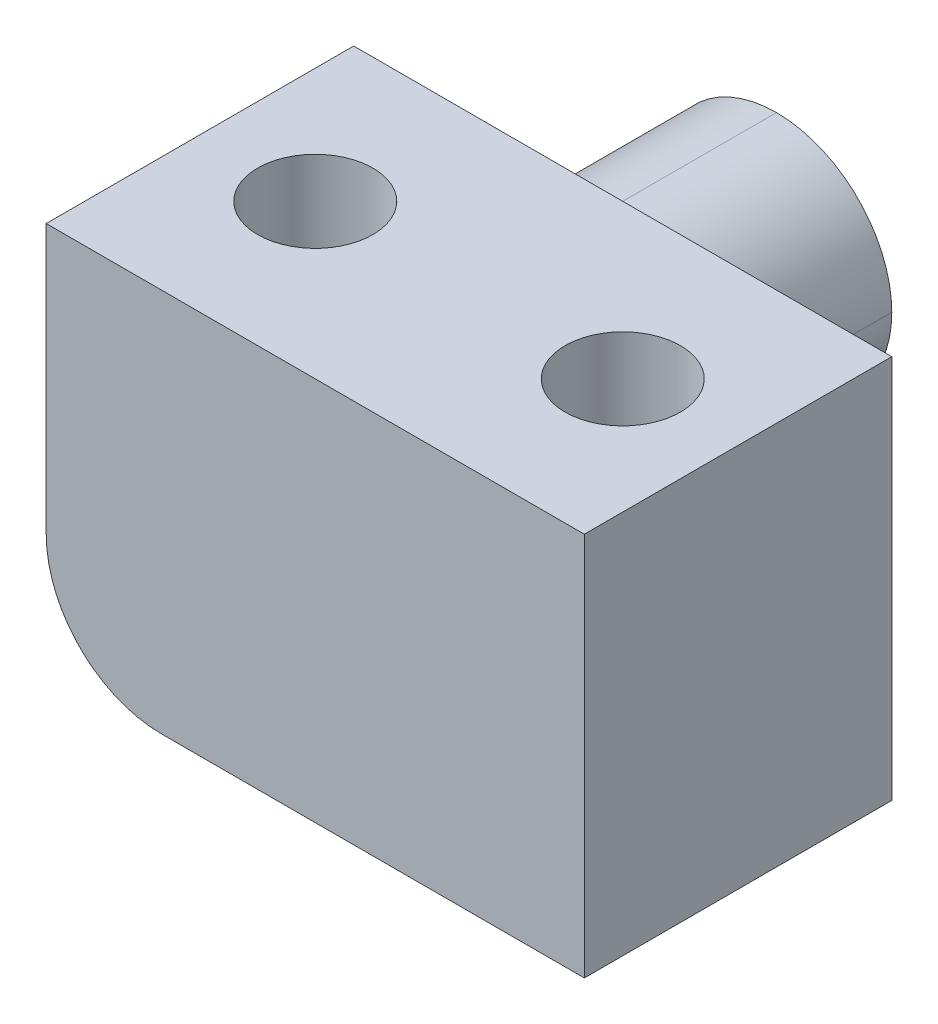
ISO-10303-21;
HEADER;
FILE_DESCRIPTION(('STEP AP214'),'2;1');
FILE_NAME('part.step','',(''),(''),'','','');
FILE_SCHEMA(('AUTOMOTIVE_DESIGN { 1 0 10303 214 1 1 1 1 }'));
ENDSEC;
DATA;
#1=APPLICATION_CONTEXT('core data for automotive mechanical design processes');
#2=APPLICATION_PROTOCOL_DEFINITION('international standard','automotive_design',2000,#1);
#3=PRODUCT_CONTEXT('',#1,'mechanical');
#4=PRODUCT('Part','Part','',(#3));
#5=PRODUCT_RELATED_PRODUCT_CATEGORY('part','',(#4));
#6=PRODUCT_DEFINITION_FORMATION('','',#4);
#7=PRODUCT_DEFINITION_CONTEXT('part definition',#1,'design');
#8=PRODUCT_DEFINITION('design','',#6,#7);
#9=PRODUCT_DEFINITION_SHAPE('','',#8);
#10=(LENGTH_UNIT() NAMED_UNIT(*) SI_UNIT(.MILLI.,.METRE.));
#11=(NAMED_UNIT(*) PLANE_ANGLE_UNIT() SI_UNIT($,.RADIAN.));
#12=(NAMED_UNIT(*) SI_UNIT($,.STERADIAN.) SOLID_ANGLE_UNIT());
#13=UNCERTAINTY_MEASURE_WITH_UNIT(LENGTH_MEASURE(1.E-05),#10,'distance_accuracy_value','');
#14=(GEOMETRIC_REPRESENTATION_CONTEXT(3) GLOBAL_UNCERTAINTY_ASSIGNED_CONTEXT((#13)) GLOBAL_UNIT_ASSIGNED_CONTEXT((#10,
#11,#12)) REPRESENTATION_CONTEXT('',''));
#15=CARTESIAN_POINT('',(0.,0.,0.));
#16=DIRECTION('',(0.,0.,1.));
#17=DIRECTION('',(1.,0.,0.));
#18=AXIS2_PLACEMENT_3D('',#15,#16,#17);
#19=CARTESIAN_POINT('',(-1.5,3.,4.));
#20=DIRECTION('',(1.,0.,0.));
#21=DIRECTION('',(0.,0.,-1.));
#22=AXIS2_PLACEMENT_3D('',#19,#20,#21);
#23=PLANE('',#22);
#24=DIRECTION('',(0.,-1.,0.));
#25=VECTOR('',#24,1.);
#26=CARTESIAN_POINT('',(-1.5,5.,0.));
#27=LINE('',#26,#25);
#28=CARTESIAN_POINT('',(-1.5,5.,0.));
#29=VERTEX_POINT('',#28);
#30=CARTESIAN_POINT('',(-1.5,1.5,0.));
#31=VERTEX_POINT('',#30);
#32=EDGE_CURVE('E106',#29,#31,#27,.T.);
#33=ORIENTED_EDGE('',*,*,#32,.T.);
#34=DIRECTION('',(0.,0.,1.));
#35=VECTOR('',#34,1.);
#36=CARTESIAN_POINT('',(-1.5,1.5,4.));
#37=LINE('',#36,#35);
#38=CARTESIAN_POINT('',(-1.5,1.5,4.));
#39=VERTEX_POINT('',#38);
#40=EDGE_CURVE('E163',#31,#39,#37,.T.);
#41=ORIENTED_EDGE('',*,*,#40,.T.);
#42=DIRECTION('',(0.,-1.,0.));
#43=VECTOR('',#42,1.);
#44=CARTESIAN_POINT('',(-1.5,3.,4.));
#45=LINE('',#44,#43);
#46=CARTESIAN_POINT('',(-1.5,5.,4.));
#47=VERTEX_POINT('',#46);
#48=EDGE_CURVE('E128',#47,#39,#45,.T.);
#49=ORIENTED_EDGE('',*,*,#48,.F.);
#50=DIRECTION('',(0.,0.,-1.));
#51=VECTOR('',#50,1.);
#52=CARTESIAN_POINT('',(-1.5,5.,4.));
#53=LINE('',#52,#51);
#54=EDGE_CURVE('E122',#47,#29,#53,.T.);
#55=ORIENTED_EDGE('',*,*,#54,.T.);
#56=EDGE_LOOP('',(#33,#41,#49,#55));
#57=FACE_BOUND('',#56,.T.);
#58=ADVANCED_FACE('F34',(#57),#23,.F.);
#59=CARTESIAN_POINT('',(1.5,3.,4.));
#60=DIRECTION('',(0.,0.,-1.));
#61=DIRECTION('',(-1.,0.,0.));
#62=AXIS2_PLACEMENT_3D('',#59,#60,#61);
#63=PLANE('',#62);
#64=ORIENTED_EDGE('',*,*,#48,.T.);
#65=CARTESIAN_POINT('',(0.,1.5,4.));
#66=DIRECTION('',(0.,0.,-1.));
#67=DIRECTION('',(-1.,0.,0.));
#68=AXIS2_PLACEMENT_3D('',#65,#66,#67);
#69=CIRCLE('',#68,1.5);
#70=CARTESIAN_POINT('',(0.,0.,4.));
#71=VERTEX_POINT('',#70);
#72=EDGE_CURVE('E165',#39,#71,#69,.F.);
#73=ORIENTED_EDGE('',*,*,#72,.T.);
#74=DIRECTION('',(1.,0.,0.));
#75=VECTOR('',#74,1.);
#76=CARTESIAN_POINT('',(1.5,0.,4.));
#77=LINE('',#76,#75);
#78=CARTESIAN_POINT('',(5.5,0.,4.));
#79=VERTEX_POINT('',#78);
#80=EDGE_CURVE('E146',#71,#79,#77,.T.);
#81=ORIENTED_EDGE('',*,*,#80,.T.);
#82=DIRECTION('',(0.,-1.,0.));
#83=VECTOR('',#82,1.);
#84=CARTESIAN_POINT('',(5.5,3.,4.));
#85=LINE('',#84,#83);
#86=CARTESIAN_POINT('',(5.5,5.,4.));
#87=VERTEX_POINT('',#86);
#88=EDGE_CURVE('E114',#87,#79,#85,.T.);
#89=ORIENTED_EDGE('',*,*,#88,.F.);
#90=DIRECTION('',(-1.,0.,0.));
#91=VECTOR('',#90,1.);
#92=CARTESIAN_POINT('',(-1.5,5.,4.));
#93=LINE('',#92,#91);
#94=EDGE_CURVE('E115',#87,#47,#93,.T.);
#95=ORIENTED_EDGE('',*,*,#94,.T.);
#96=EDGE_LOOP('',(#64,#73,#81,#89,#95));
#97=FACE_BOUND('',#96,.T.);
#98=ADVANCED_FACE('F201',(#97),#63,.F.);
#99=CARTESIAN_POINT('',(1.5,3.,-4.));
#100=DIRECTION('',(0.,0.,1.));
#101=DIRECTION('',(1.,0.,0.));
#102=AXIS2_PLACEMENT_3D('',#99,#100,#101);
#103=PLANE('',#102);
#104=CARTESIAN_POINT('',(0.,1.5,-4.));
#105=DIRECTION('',(0.,0.,1.));
#106=DIRECTION('',(1.,0.,0.));
#107=AXIS2_PLACEMENT_3D('',#104,#105,#106);
#108=CIRCLE('',#107,1.5);
#109=CARTESIAN_POINT('',(0.,3.,-4.));
#110=VERTEX_POINT('',#109);
#111=CARTESIAN_POINT('',(1.5,1.5,-4.));
#112=VERTEX_POINT('',#111);
#113=EDGE_CURVE('E153',#110,#112,#108,.F.);
#114=ORIENTED_EDGE('',*,*,#113,.T.);
#115=CARTESIAN_POINT('',(0.,1.5,-4.));
#116=DIRECTION('',(0.,0.,1.));
#117=DIRECTION('',(1.,0.,0.));
#118=AXIS2_PLACEMENT_3D('',#115,#116,#117);
#119=CIRCLE('',#118,1.5);
#120=CARTESIAN_POINT('',(0.,0.,-4.));
#121=VERTEX_POINT('',#120);
#122=EDGE_CURVE('E155',#112,#121,#119,.F.);
#123=ORIENTED_EDGE('',*,*,#122,.T.);
#124=CARTESIAN_POINT('',(0.,1.5,-4.));
#125=DIRECTION('',(0.,0.,1.));
#126=DIRECTION('',(1.,0.,0.));
#127=AXIS2_PLACEMENT_3D('',#124,#125,#126);
#128=CIRCLE('',#127,1.5);
#129=CARTESIAN_POINT('',(-1.5,1.5,-4.));
#130=VERTEX_POINT('',#129);
#131=EDGE_CURVE('E149',#121,#130,#128,.F.);
#132=ORIENTED_EDGE('',*,*,#131,.T.);
#133=CARTESIAN_POINT('',(0.,1.5,-4.));
#134=DIRECTION('',(0.,0.,1.));
#135=DIRECTION('',(1.,0.,0.));
#136=AXIS2_PLACEMENT_3D('',#133,#134,#135);
#137=CIRCLE('',#136,1.5);
#138=EDGE_CURVE('E151',#130,#110,#137,.F.);
#139=ORIENTED_EDGE('',*,*,#138,.T.);
#140=EDGE_LOOP('',(#114,#123,#132,#139));
#141=FACE_BOUND('',#140,.T.);
#142=ADVANCED_FACE('F197',(#141),#103,.F.);
#143=CARTESIAN_POINT('',(0.,0.,0.));
#144=DIRECTION('',(0.,1.,0.));
#145=DIRECTION('',(0.,0.,1.));
#146=AXIS2_PLACEMENT_3D('',#143,#144,#145);
#147=PLANE('',#146);
#148=CARTESIAN_POINT('',(4.,0.,2.));
#149=DIRECTION('',(0.,1.,0.));
#150=DIRECTION('',(0.,0.,1.));
#151=AXIS2_PLACEMENT_3D('',#148,#149,#150);
#152=CIRCLE('',#151,0.75);
#153=CARTESIAN_POINT('',(4.,0.,2.75));
#154=VERTEX_POINT('',#153);
#155=EDGE_CURVE('E253',#154,#154,#152,.F.);
#156=ORIENTED_EDGE('',*,*,#155,.F.);
#157=EDGE_LOOP('',(#156));
#158=FACE_BOUND('',#157,.T.);
#159=ORIENTED_EDGE('',*,*,#80,.F.);
#160=DIRECTION('',(0.,0.,1.));
#161=VECTOR('',#160,1.);
#162=CARTESIAN_POINT('',(0.,0.,0.));
#163=LINE('',#162,#161);
#164=CARTESIAN_POINT('',(0.,0.,2.75));
#165=VERTEX_POINT('',#164);
#166=EDGE_CURVE('E161',#71,#165,#163,.F.);
#167=ORIENTED_EDGE('',*,*,#166,.T.);
#168=CARTESIAN_POINT('',(0.,0.,2.));
#169=DIRECTION('',(0.,1.,0.));
#170=DIRECTION('',(0.,0.,1.));
#171=AXIS2_PLACEMENT_3D('',#168,#169,#170);
#172=CIRCLE('',#171,0.75);
#173=CARTESIAN_POINT('',(0.,0.,1.25));
#174=VERTEX_POINT('',#173);
#175=EDGE_CURVE('E129',#174,#165,#172,.F.);
#176=ORIENTED_EDGE('',*,*,#175,.F.);
#177=DIRECTION('',(0.,0.,1.));
#178=VECTOR('',#177,1.);
#179=CARTESIAN_POINT('',(0.,0.,0.));
#180=LINE('',#179,#178);
#181=CARTESIAN_POINT('',(0.,0.,0.));
#182=VERTEX_POINT('',#181);
#183=EDGE_CURVE('E158',#174,#182,#180,.F.);
#184=ORIENTED_EDGE('',*,*,#183,.T.);
#185=DIRECTION('',(-1.,0.,0.));
#186=VECTOR('',#185,1.);
#187=CARTESIAN_POINT('',(5.5,0.,0.));
#188=LINE('',#187,#186);
#189=CARTESIAN_POINT('',(5.5,0.,0.));
#190=VERTEX_POINT('',#189);
#191=EDGE_CURVE('E144',#190,#182,#188,.T.);
#192=ORIENTED_EDGE('',*,*,#191,.F.);
#193=DIRECTION('',(0.,0.,-1.));
#194=VECTOR('',#193,1.);
#195=CARTESIAN_POINT('',(5.5,0.,4.));
#196=LINE('',#195,#194);
#197=EDGE_CURVE('E140',#79,#190,#196,.T.);
#198=ORIENTED_EDGE('',*,*,#197,.F.);
#199=EDGE_LOOP('',(#159,#167,#176,#184,#192,#198));
#200=FACE_BOUND('',#199,.T.);
#201=ADVANCED_FACE('F194',(#158,#200),#147,.F.);
#202=CARTESIAN_POINT('',(5.5,3.,0.));
#203=DIRECTION('',(0.,0.,1.));
#204=DIRECTION('',(1.,0.,0.));
#205=AXIS2_PLACEMENT_3D('',#202,#203,#204);
#206=PLANE('',#205);
#207=CARTESIAN_POINT('',(0.,1.5,0.));
#208=DIRECTION('',(0.,0.,1.));
#209=DIRECTION('',(1.,0.,0.));
#210=AXIS2_PLACEMENT_3D('',#207,#208,#209);
#211=CIRCLE('',#210,1.5);
#212=CARTESIAN_POINT('',(1.5,1.5,0.));
#213=VERTEX_POINT('',#212);
#214=CARTESIAN_POINT('',(0.,3.,0.));
#215=VERTEX_POINT('',#214);
#216=EDGE_CURVE('E43',#213,#215,#211,.T.);
#217=ORIENTED_EDGE('',*,*,#216,.T.);
#218=CARTESIAN_POINT('',(0.,1.5,0.));
#219=DIRECTION('',(0.,0.,1.));
#220=DIRECTION('',(1.,0.,0.));
#221=AXIS2_PLACEMENT_3D('',#218,#219,#220);
#222=CIRCLE('',#221,1.5);
#223=EDGE_CURVE('E12',#215,#31,#222,.T.);
#224=ORIENTED_EDGE('',*,*,#223,.T.);
#225=ORIENTED_EDGE('',*,*,#32,.F.);
#226=DIRECTION('',(1.,0.,0.));
#227=VECTOR('',#226,1.);
#228=CARTESIAN_POINT('',(-1.5,5.,0.));
#229=LINE('',#228,#227);
#230=CARTESIAN_POINT('',(5.5,5.,0.));
#231=VERTEX_POINT('',#230);
#232=EDGE_CURVE('E110',#29,#231,#229,.T.);
#233=ORIENTED_EDGE('',*,*,#232,.T.);
#234=DIRECTION('',(0.,1.,0.));
#235=VECTOR('',#234,1.);
#236=CARTESIAN_POINT('',(5.5,3.,0.));
#237=LINE('',#236,#235);
#238=EDGE_CURVE('E142',#190,#231,#237,.T.);
#239=ORIENTED_EDGE('',*,*,#238,.F.);
#240=ORIENTED_EDGE('',*,*,#191,.T.);
#241=CARTESIAN_POINT('',(0.,1.5,0.));
#242=DIRECTION('',(0.,0.,1.));
#243=DIRECTION('',(1.,0.,0.));
#244=AXIS2_PLACEMENT_3D('',#241,#242,#243);
#245=CIRCLE('',#244,1.5);
#246=EDGE_CURVE('E173',#182,#213,#245,.T.);
#247=ORIENTED_EDGE('',*,*,#246,.T.);
#248=EDGE_LOOP('',(#217,#224,#225,#233,#239,#240,#247));
#249=FACE_BOUND('',#248,.T.);
#250=ADVANCED_FACE('F108',(#249),#206,.F.);
#251=CARTESIAN_POINT('',(5.5,0.,0.));
#252=DIRECTION('',(1.,0.,0.));
#253=DIRECTION('',(0.,0.,-1.));
#254=AXIS2_PLACEMENT_3D('',#251,#252,#253);
#255=PLANE('',#254);
#256=ORIENTED_EDGE('',*,*,#88,.T.);
#257=ORIENTED_EDGE('',*,*,#197,.T.);
#258=ORIENTED_EDGE('',*,*,#238,.T.);
#259=DIRECTION('',(0.,0.,1.));
#260=VECTOR('',#259,1.);
#261=CARTESIAN_POINT('',(5.5,5.,4.));
#262=LINE('',#261,#260);
#263=EDGE_CURVE('E125',#231,#87,#262,.T.);
#264=ORIENTED_EDGE('',*,*,#263,.T.);
#265=EDGE_LOOP('',(#256,#257,#258,#264));
#266=FACE_BOUND('',#265,.T.);
#267=ADVANCED_FACE('F187',(#266),#255,.T.);
#268=CARTESIAN_POINT('',(0.,5.,0.));
#269=DIRECTION('',(0.,-1.,0.));
#270=DIRECTION('',(0.,0.,-1.));
#271=AXIS2_PLACEMENT_3D('',#268,#269,#270);
#272=PLANE('',#271);
#273=CARTESIAN_POINT('',(4.,5.,2.));
#274=DIRECTION('',(0.,1.,0.));
#275=DIRECTION('',(0.,0.,1.));
#276=AXIS2_PLACEMENT_3D('',#273,#274,#275);
#277=CIRCLE('',#276,0.75);
#278=CARTESIAN_POINT('',(4.,5.,2.75));
#279=VERTEX_POINT('',#278);
#280=EDGE_CURVE('E225',#279,#279,#277,.T.);
#281=ORIENTED_EDGE('',*,*,#280,.F.);
#282=EDGE_LOOP('',(#281));
#283=FACE_BOUND('',#282,.T.);
#284=CARTESIAN_POINT('',(0.,5.,2.));
#285=DIRECTION('',(0.,1.,0.));
#286=DIRECTION('',(0.,0.,1.));
#287=AXIS2_PLACEMENT_3D('',#284,#285,#286);
#288=CIRCLE('',#287,0.75);
#289=CARTESIAN_POINT('',(0.,5.,2.75));
#290=VERTEX_POINT('',#289);
#291=EDGE_CURVE('E132',#290,#290,#288,.T.);
#292=ORIENTED_EDGE('',*,*,#291,.F.);
#293=EDGE_LOOP('',(#292));
#294=FACE_BOUND('',#293,.T.);
#295=ORIENTED_EDGE('',*,*,#54,.F.);
#296=ORIENTED_EDGE('',*,*,#94,.F.);
#297=ORIENTED_EDGE('',*,*,#263,.F.);
#298=ORIENTED_EDGE('',*,*,#232,.F.);
#299=EDGE_LOOP('',(#295,#296,#297,#298));
#300=FACE_BOUND('',#299,.T.);
#301=ADVANCED_FACE('F120',(#283,#294,#300),#272,.F.);
#302=CARTESIAN_POINT('',(0.,-0.00100000000000013,2.));
#303=DIRECTION('',(0.,1.,0.));
#304=DIRECTION('',(0.,0.,1.));
#305=AXIS2_PLACEMENT_3D('',#302,#303,#304);
#306=CYLINDRICAL_SURFACE('',#305,0.75);
#307=ORIENTED_EDGE('',*,*,#291,.T.);
#308=EDGE_LOOP('',(#307));
#309=FACE_BOUND('',#308,.T.);
#310=ORIENTED_EDGE('',*,*,#175,.T.);
#311=CARTESIAN_POINT('',(0.,0.,2.75));
#312=CARTESIAN_POINT('',(-0.0198038942224365,-2.02460036183125E-06,2.75000105204786));
#313=CARTESIAN_POINT('',(-0.0395972609308654,0.000392627124019105,2.74921507380272));
#314=CARTESIAN_POINT('',(-0.0790222519564933,0.00195338818521222,2.74608737427137));
#315=CARTESIAN_POINT('',(-0.0986539380229295,0.00311918771604518,2.743746277747));
#316=CARTESIAN_POINT('',(-0.156909560481623,0.00772438186452773,2.73445031271447));
#317=CARTESIAN_POINT('',(-0.195110178651676,0.0122720616402338,2.72522230333495));
#318=CARTESIAN_POINT('',(-0.269188298073867,0.0238745486835948,2.70111107925428));
#319=CARTESIAN_POINT('',(-0.305068401536148,0.0309264879723588,2.68623433237113));
#320=CARTESIAN_POINT('',(-0.373816635272954,0.0468970775147433,2.65134374388999));
#321=CARTESIAN_POINT('',(-0.406681710607611,0.0558175916846244,2.63132476833748));
#322=CARTESIAN_POINT('',(-0.470633251445993,0.0753285737046171,2.58536080937505));
#323=CARTESIAN_POINT('',(-0.501494800824534,0.0859871128996009,2.55913240447351));
#324=CARTESIAN_POINT('',(-0.558587129168786,0.10755135927652,2.50210569482815));
#325=CARTESIAN_POINT('',(-0.584814864409554,0.118457223647404,2.47130441064511));
#326=CARTESIAN_POINT('',(-0.633939355800852,0.140257999154618,2.40313706696632));
#327=CARTESIAN_POINT('',(-0.656419552454913,0.151086355967921,2.36544702549571));
#328=CARTESIAN_POINT('',(-0.694626532798632,0.170355361847721,2.28622350525272));
#329=CARTESIAN_POINT('',(-0.710358300668783,0.178797771523087,2.24469289066251));
#330=CARTESIAN_POINT('',(-0.733599207053166,0.191565926920202,2.16150162973518));
#331=CARTESIAN_POINT('',(-0.74154421381643,0.196107860833993,2.11999760619497));
#332=CARTESIAN_POINT('',(-0.750320223925136,0.201135812981198,2.03601683869647));
#333=CARTESIAN_POINT('',(-0.751158096574061,0.201625747607777,1.99354107379668));
#334=CARTESIAN_POINT('',(-0.746015439971854,0.198668008229815,1.9142850791309));
#335=CARTESIAN_POINT('',(-0.740838308460235,0.195684207504472,1.87743117735349));
#336=CARTESIAN_POINT('',(-0.725204658736934,0.186928159544114,1.8052078000876));
#337=CARTESIAN_POINT('',(-0.714746572928476,0.18115508436376,1.76983876874615));
#338=CARTESIAN_POINT('',(-0.688657522996867,0.16734402385866,1.70057863594758));
#339=CARTESIAN_POINT('',(-0.672911755814672,0.159256420469932,1.66674114011952));
#340=CARTESIAN_POINT('',(-0.636781809634147,0.141724727399788,1.60202513121729));
#341=CARTESIAN_POINT('',(-0.616395419589275,0.132279991899984,1.57114803863994));
#342=CARTESIAN_POINT('',(-0.568550404796712,0.111651659128525,1.50911008628147));
#343=CARTESIAN_POINT('',(-0.540522899378296,0.100399393963405,1.47840929209293));
#344=CARTESIAN_POINT('',(-0.479668388526051,0.0783934635546409,1.42194997721608));
#345=CARTESIAN_POINT('',(-0.446838808480887,0.0676400698781249,1.39619412497539));
#346=CARTESIAN_POINT('',(-0.375370144530761,0.0472299140877428,1.34922379199313));
#347=CARTESIAN_POINT('',(-0.336530711389018,0.0376483111700167,1.32827919861814));
#348=CARTESIAN_POINT('',(-0.25530154234492,0.0213085727417383,1.29341219769506));
#349=CARTESIAN_POINT('',(-0.212918350729677,0.0145453649480249,1.27947716555115));
#350=CARTESIAN_POINT('',(-0.141826205161583,0.00646025592236373,1.26298446882502));
#351=CARTESIAN_POINT('',(-0.113753883518015,0.00405386380780832,1.25813188971007));
#352=CARTESIAN_POINT('',(-0.0571293455956458,0.000816934008377158,1.25163358910535));
#353=CARTESIAN_POINT('',(-0.028576758485646,-1.23237106464735E-05,1.24999047231185));
#354=CARTESIAN_POINT('',(0.,0.,1.25));
#355=B_SPLINE_CURVE_WITH_KNOTS('',3,(#311,#312,#313,#314,#315,#316,#317,#318,#319,#320,#321,
#322,#323,#324,#325,#326,#327,#328,#329,#330,#331,#332,#333,#334,#335,#336,#337,#338,#339,#340,
#341,#342,#343,#344,#345,#346,#347,#348,#349,#350,#351,#352,#353,#354),.UNSPECIFIED.,.F.,.F.,(4,
2,2,2,2,2,2,2,2,2,2,2,2,2,2,2,2,2,2,2,2,4),(0.,0.0593718053614129,0.118719772779186,
0.236776306726963,0.354698071303768,0.472738028628158,0.59785801638984,0.723059886224724,
0.85797976200146,0.992799817848663,1.11954886384173,1.2461753882982,1.35765925674039,
1.46917623748876,1.58329043541203,1.69745911780581,1.82609830573005,1.95480671752432,
2.0895560711494,2.22406185713001,2.30961966302259,2.39524687607319),.UNSPECIFIED.);
#356=EDGE_CURVE('E167',#165,#174,#355,.T.);
#357=ORIENTED_EDGE('',*,*,#356,.T.);
#358=EDGE_LOOP('',(#310,#357));
#359=FACE_BOUND('',#358,.T.);
#360=ADVANCED_FACE('F178',(#309,#359),#306,.F.);
#361=CARTESIAN_POINT('',(4.,-0.00100000000000013,2.));
#362=DIRECTION('',(0.,1.,0.));
#363=DIRECTION('',(0.,0.,1.));
#364=AXIS2_PLACEMENT_3D('',#361,#362,#363);
#365=CYLINDRICAL_SURFACE('',#364,0.75);
#366=ORIENTED_EDGE('',*,*,#280,.T.);
#367=EDGE_LOOP('',(#366));
#368=FACE_BOUND('',#367,.T.);
#369=ORIENTED_EDGE('',*,*,#155,.T.);
#370=EDGE_LOOP('',(#369));
#371=FACE_BOUND('',#370,.T.);
#372=ADVANCED_FACE('F183',(#368,#371),#365,.F.);
#373=CARTESIAN_POINT('',(0.,1.5,0.));
#374=DIRECTION('',(0.,0.,-1.));
#375=DIRECTION('',(-1.,0.,0.));
#376=AXIS2_PLACEMENT_3D('',#373,#374,#375);
#377=CYLINDRICAL_SURFACE('',#376,1.5);
#378=DIRECTION('',(0.,0.,1.));
#379=VECTOR('',#378,1.);
#380=CARTESIAN_POINT('',(0.,3.,0.));
#381=LINE('',#380,#379);
#382=EDGE_CURVE('E220',#110,#215,#381,.T.);
#383=ORIENTED_EDGE('',*,*,#382,.F.);
#384=ORIENTED_EDGE('',*,*,#138,.F.);
#385=DIRECTION('',(0.,0.,1.));
#386=VECTOR('',#385,1.);
#387=CARTESIAN_POINT('',(-1.5,1.5,-4.));
#388=LINE('',#387,#386);
#389=EDGE_CURVE('E38',#31,#130,#388,.F.);
#390=ORIENTED_EDGE('',*,*,#389,.F.);
#391=ORIENTED_EDGE('',*,*,#223,.F.);
#392=EDGE_LOOP('',(#383,#384,#390,#391));
#393=FACE_BOUND('',#392,.T.);
#394=ADVANCED_FACE('F36',(#393),#377,.T.);
#395=CARTESIAN_POINT('',(0.,1.5,4.));
#396=DIRECTION('',(0.,0.,1.));
#397=DIRECTION('',(1.,0.,0.));
#398=AXIS2_PLACEMENT_3D('',#395,#396,#397);
#399=CYLINDRICAL_SURFACE('',#398,1.5);
#400=ORIENTED_EDGE('',*,*,#389,.T.);
#401=ORIENTED_EDGE('',*,*,#131,.F.);
#402=DIRECTION('',(0.,0.,1.));
#403=VECTOR('',#402,1.);
#404=CARTESIAN_POINT('',(0.,0.,0.));
#405=LINE('',#404,#403);
#406=EDGE_CURVE('E223',#182,#121,#405,.F.);
#407=ORIENTED_EDGE('',*,*,#406,.F.);
#408=ORIENTED_EDGE('',*,*,#183,.F.);
#409=ORIENTED_EDGE('',*,*,#356,.F.);
#410=ORIENTED_EDGE('',*,*,#166,.F.);
#411=ORIENTED_EDGE('',*,*,#72,.F.);
#412=ORIENTED_EDGE('',*,*,#40,.F.);
#413=EDGE_LOOP('',(#400,#401,#407,#408,#409,#410,#411,#412));
#414=FACE_BOUND('',#413,.T.);
#415=ADVANCED_FACE('F175',(#414),#399,.T.);
#416=CARTESIAN_POINT('',(0.,1.5,0.));
#417=DIRECTION('',(0.,0.,1.));
#418=DIRECTION('',(1.,0.,0.));
#419=AXIS2_PLACEMENT_3D('',#416,#417,#418);
#420=CYLINDRICAL_SURFACE('',#419,1.5);
#421=ORIENTED_EDGE('',*,*,#382,.T.);
#422=ORIENTED_EDGE('',*,*,#216,.F.);
#423=DIRECTION('',(0.,0.,-1.));
#424=VECTOR('',#423,1.);
#425=CARTESIAN_POINT('',(1.5,1.5,0.));
#426=LINE('',#425,#424);
#427=EDGE_CURVE('E57',#112,#213,#426,.F.);
#428=ORIENTED_EDGE('',*,*,#427,.F.);
#429=ORIENTED_EDGE('',*,*,#113,.F.);
#430=EDGE_LOOP('',(#421,#422,#428,#429));
#431=FACE_BOUND('',#430,.T.);
#432=ADVANCED_FACE('F210',(#431),#420,.T.);
#433=CARTESIAN_POINT('',(0.,1.5,4.));
#434=DIRECTION('',(0.,0.,-1.));
#435=DIRECTION('',(-1.,0.,0.));
#436=AXIS2_PLACEMENT_3D('',#433,#434,#435);
#437=CYLINDRICAL_SURFACE('',#436,1.5);
#438=ORIENTED_EDGE('',*,*,#246,.F.);
#439=ORIENTED_EDGE('',*,*,#406,.T.);
#440=ORIENTED_EDGE('',*,*,#122,.F.);
#441=ORIENTED_EDGE('',*,*,#427,.T.);
#442=EDGE_LOOP('',(#438,#439,#440,#441));
#443=FACE_BOUND('',#442,.T.);
#444=ADVANCED_FACE('F208',(#443),#437,.T.);
#445=CLOSED_SHELL('',(#58,#98,#142,#201,#250,#267,#301,#360,#372,#394,#415,#432,#444));
#446=MANIFOLD_SOLID_BREP('B2',#445);
#447=ADVANCED_BREP_SHAPE_REPRESENTATION('',(#18,#446),#14);
#448=SHAPE_DEFINITION_REPRESENTATION(#9,#447);
ENDSEC;
END-ISO-10303-21;
